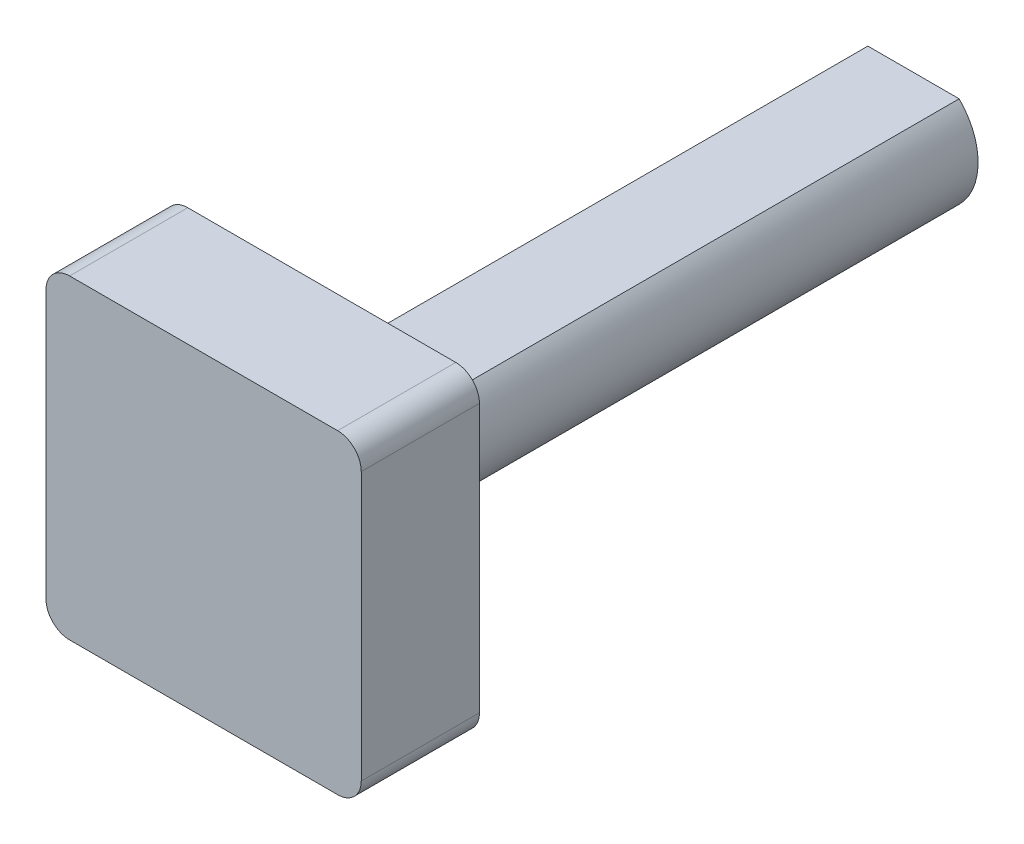
ISO-10303-21;
HEADER;
FILE_DESCRIPTION(('STEP AP214'),'2;1');
FILE_NAME('part.step','',(''),(''),'','','');
FILE_SCHEMA(('AUTOMOTIVE_DESIGN { 1 0 10303 214 1 1 1 1 }'));
ENDSEC;
DATA;
#1=APPLICATION_CONTEXT('core data for automotive mechanical design processes');
#2=APPLICATION_PROTOCOL_DEFINITION('international standard','automotive_design',2000,#1);
#3=PRODUCT_CONTEXT('',#1,'mechanical');
#4=PRODUCT('Part','Part','',(#3));
#5=PRODUCT_RELATED_PRODUCT_CATEGORY('part','',(#4));
#6=PRODUCT_DEFINITION_FORMATION('','',#4);
#7=PRODUCT_DEFINITION_CONTEXT('part definition',#1,'design');
#8=PRODUCT_DEFINITION('design','',#6,#7);
#9=PRODUCT_DEFINITION_SHAPE('','',#8);
#10=(LENGTH_UNIT() NAMED_UNIT(*) SI_UNIT(.MILLI.,.METRE.));
#11=(NAMED_UNIT(*) PLANE_ANGLE_UNIT() SI_UNIT($,.RADIAN.));
#12=(NAMED_UNIT(*) SI_UNIT($,.STERADIAN.) SOLID_ANGLE_UNIT());
#13=UNCERTAINTY_MEASURE_WITH_UNIT(LENGTH_MEASURE(1.E-05),#10,'distance_accuracy_value','');
#14=(GEOMETRIC_REPRESENTATION_CONTEXT(3) GLOBAL_UNCERTAINTY_ASSIGNED_CONTEXT((#13)) GLOBAL_UNIT_ASSIGNED_CONTEXT((#10,
#11,#12)) REPRESENTATION_CONTEXT('',''));
#15=CARTESIAN_POINT('',(0.,0.,0.));
#16=DIRECTION('',(0.,0.,1.));
#17=DIRECTION('',(1.,0.,0.));
#18=AXIS2_PLACEMENT_3D('',#15,#16,#17);
#19=CARTESIAN_POINT('',(0.039843902833861,0.248435462917591,-114.3));
#20=DIRECTION('',(0.,0.,1.));
#21=DIRECTION('',(1.,0.,0.));
#22=AXIS2_PLACEMENT_3D('',#19,#20,#21);
#23=CYLINDRICAL_SURFACE('',#22,10.414);
#24=CARTESIAN_POINT('',(0.039843902833861,0.248435462917591,-19.05));
#25=DIRECTION('',(0.,0.,-1.));
#26=DIRECTION('',(-1.,0.,0.));
#27=AXIS2_PLACEMENT_3D('',#24,#25,#26);
#28=CIRCLE('',#27,10.414);
#29=CARTESIAN_POINT('',(7.39929628569946,-7.11972961560324,-19.05));
#30=VERTEX_POINT('',#29);
#31=CARTESIAN_POINT('',(7.39929628569946,7.61660054143842,-19.05));
#32=VERTEX_POINT('',#31);
#33=EDGE_CURVE('E55',#30,#32,#28,.F.);
#34=ORIENTED_EDGE('',*,*,#33,.F.);
#35=DIRECTION('',(0.,0.,1.));
#36=VECTOR('',#35,1.);
#37=CARTESIAN_POINT('',(7.39929628569946,-7.11972961560324,-114.3));
#38=LINE('',#37,#36);
#39=CARTESIAN_POINT('',(7.39929628569946,-7.11972961560324,-114.3));
#40=VERTEX_POINT('',#39);
#41=EDGE_CURVE('E48',#40,#30,#38,.T.);
#42=ORIENTED_EDGE('',*,*,#41,.F.);
#43=CARTESIAN_POINT('',(0.039843902833861,0.248435462917591,-114.3));
#44=DIRECTION('',(0.,0.,1.));
#45=DIRECTION('',(1.,0.,0.));
#46=AXIS2_PLACEMENT_3D('',#43,#44,#45);
#47=CIRCLE('',#46,10.414);
#48=CARTESIAN_POINT('',(7.39929628569946,7.61660054143842,-114.3));
#49=VERTEX_POINT('',#48);
#50=EDGE_CURVE('E210',#40,#49,#47,.T.);
#51=ORIENTED_EDGE('',*,*,#50,.T.);
#52=DIRECTION('',(0.,0.,1.));
#53=VECTOR('',#52,1.);
#54=CARTESIAN_POINT('',(7.39929628569946,7.61660054143842,-114.3));
#55=LINE('',#54,#53);
#56=EDGE_CURVE('E222',#49,#32,#55,.T.);
#57=ORIENTED_EDGE('',*,*,#56,.T.);
#58=EDGE_LOOP('',(#34,#42,#51,#57));
#59=FACE_BOUND('',#58,.T.);
#60=ADVANCED_FACE('F41',(#59),#23,.T.);
#61=CARTESIAN_POINT('',(-7.31960848003174,-7.11972961560324,-114.3));
#62=DIRECTION('',(0.,-1.,0.));
#63=DIRECTION('',(0.,0.,-1.));
#64=AXIS2_PLACEMENT_3D('',#61,#62,#63);
#65=PLANE('',#64);
#66=DIRECTION('',(1.,0.,0.));
#67=VECTOR('',#66,1.);
#68=CARTESIAN_POINT('',(-7.31960848003174,-7.11972961560324,-19.05));
#69=LINE('',#68,#67);
#70=CARTESIAN_POINT('',(-7.31960848003174,-7.11972961560324,-19.05));
#71=VERTEX_POINT('',#70);
#72=EDGE_CURVE('E62',#71,#30,#69,.T.);
#73=ORIENTED_EDGE('',*,*,#72,.F.);
#74=DIRECTION('',(0.,0.,1.));
#75=VECTOR('',#74,1.);
#76=CARTESIAN_POINT('',(-7.31960848003174,-7.11972961560324,-114.3));
#77=LINE('',#76,#75);
#78=CARTESIAN_POINT('',(-7.31960848003174,-7.11972961560324,-114.3));
#79=VERTEX_POINT('',#78);
#80=EDGE_CURVE('E224',#79,#71,#77,.T.);
#81=ORIENTED_EDGE('',*,*,#80,.F.);
#82=DIRECTION('',(1.,0.,0.));
#83=VECTOR('',#82,1.);
#84=CARTESIAN_POINT('',(-7.31960848003174,-7.11972961560324,-114.3));
#85=LINE('',#84,#83);
#86=EDGE_CURVE('E219',#79,#40,#85,.T.);
#87=ORIENTED_EDGE('',*,*,#86,.T.);
#88=ORIENTED_EDGE('',*,*,#41,.T.);
#89=EDGE_LOOP('',(#73,#81,#87,#88));
#90=FACE_BOUND('',#89,.T.);
#91=ADVANCED_FACE('F236',(#90),#65,.T.);
#92=CARTESIAN_POINT('',(0.039843902833861,0.248435462917591,-114.3));
#93=DIRECTION('',(0.,0.,1.));
#94=DIRECTION('',(1.,0.,0.));
#95=AXIS2_PLACEMENT_3D('',#92,#93,#94);
#96=CYLINDRICAL_SURFACE('',#95,10.414);
#97=CARTESIAN_POINT('',(0.039843902833861,0.248435462917591,-19.05));
#98=DIRECTION('',(0.,0.,-1.));
#99=DIRECTION('',(-1.,0.,0.));
#100=AXIS2_PLACEMENT_3D('',#97,#98,#99);
#101=CIRCLE('',#100,10.414);
#102=CARTESIAN_POINT('',(-7.31960848003174,7.61660054143842,-19.05));
#103=VERTEX_POINT('',#102);
#104=EDGE_CURVE('E194',#103,#71,#101,.F.);
#105=ORIENTED_EDGE('',*,*,#104,.F.);
#106=DIRECTION('',(0.,0.,1.));
#107=VECTOR('',#106,1.);
#108=CARTESIAN_POINT('',(-7.31960848003174,7.61660054143842,-114.3));
#109=LINE('',#108,#107);
#110=CARTESIAN_POINT('',(-7.31960848003174,7.61660054143842,-114.3));
#111=VERTEX_POINT('',#110);
#112=EDGE_CURVE('E226',#111,#103,#109,.T.);
#113=ORIENTED_EDGE('',*,*,#112,.F.);
#114=CARTESIAN_POINT('',(0.039843902833861,0.248435462917591,-114.3));
#115=DIRECTION('',(0.,0.,1.));
#116=DIRECTION('',(1.,0.,0.));
#117=AXIS2_PLACEMENT_3D('',#114,#115,#116);
#118=CIRCLE('',#117,10.414);
#119=EDGE_CURVE('E216',#111,#79,#118,.T.);
#120=ORIENTED_EDGE('',*,*,#119,.T.);
#121=ORIENTED_EDGE('',*,*,#80,.T.);
#122=EDGE_LOOP('',(#105,#113,#120,#121));
#123=FACE_BOUND('',#122,.T.);
#124=ADVANCED_FACE('F233',(#123),#96,.T.);
#125=CARTESIAN_POINT('',(-7.31960848003174,7.61660054143842,-114.3));
#126=DIRECTION('',(0.,1.,0.));
#127=DIRECTION('',(0.,0.,1.));
#128=AXIS2_PLACEMENT_3D('',#125,#126,#127);
#129=PLANE('',#128);
#130=DIRECTION('',(-1.,0.,0.));
#131=VECTOR('',#130,1.);
#132=CARTESIAN_POINT('',(-7.31960848003174,7.61660054143842,-19.05));
#133=LINE('',#132,#131);
#134=EDGE_CURVE('E11',#32,#103,#133,.T.);
#135=ORIENTED_EDGE('',*,*,#134,.F.);
#136=ORIENTED_EDGE('',*,*,#56,.F.);
#137=DIRECTION('',(-1.,0.,0.));
#138=VECTOR('',#137,1.);
#139=CARTESIAN_POINT('',(-7.31960848003174,7.61660054143842,-114.3));
#140=LINE('',#139,#138);
#141=EDGE_CURVE('E213',#49,#111,#140,.T.);
#142=ORIENTED_EDGE('',*,*,#141,.T.);
#143=ORIENTED_EDGE('',*,*,#112,.T.);
#144=EDGE_LOOP('',(#135,#136,#142,#143));
#145=FACE_BOUND('',#144,.T.);
#146=ADVANCED_FACE('F239',(#145),#129,.T.);
#147=CARTESIAN_POINT('',(0.039843902833861,0.248435462917591,-114.3));
#148=DIRECTION('',(0.,0.,1.));
#149=DIRECTION('',(1.,0.,0.));
#150=AXIS2_PLACEMENT_3D('',#147,#148,#149);
#151=PLANE('',#150);
#152=ORIENTED_EDGE('',*,*,#50,.F.);
#153=ORIENTED_EDGE('',*,*,#86,.F.);
#154=ORIENTED_EDGE('',*,*,#119,.F.);
#155=ORIENTED_EDGE('',*,*,#141,.F.);
#156=EDGE_LOOP('',(#152,#153,#154,#155));
#157=FACE_BOUND('',#156,.T.);
#158=ADVANCED_FACE('F238',(#157),#151,.F.);
#159=CARTESIAN_POINT('',(-21.7016181488463,21.6746355526609,-19.05));
#160=DIRECTION('',(0.,0.,1.));
#161=DIRECTION('',(1.,0.,0.));
#162=AXIS2_PLACEMENT_3D('',#159,#160,#161);
#163=CYLINDRICAL_SURFACE('',#162,3.81);
#164=CARTESIAN_POINT('',(-21.7016181488463,21.6746355526609,0.));
#165=DIRECTION('',(0.,0.,1.));
#166=DIRECTION('',(-1.,0.,0.));
#167=AXIS2_PLACEMENT_3D('',#164,#165,#166);
#168=CIRCLE('',#167,3.81);
#169=CARTESIAN_POINT('',(-21.7016181488463,25.4846355526609,0.));
#170=VERTEX_POINT('',#169);
#171=CARTESIAN_POINT('',(-25.5116181488463,21.6746355526608,0.));
#172=VERTEX_POINT('',#171);
#173=EDGE_CURVE('E176',#170,#172,#168,.T.);
#174=ORIENTED_EDGE('',*,*,#173,.F.);
#175=DIRECTION('',(0.,0.,1.));
#176=VECTOR('',#175,1.);
#177=CARTESIAN_POINT('',(-21.7016181488463,25.4846355526609,-19.05));
#178=LINE('',#177,#176);
#179=CARTESIAN_POINT('',(-21.7016181488463,25.4846355526609,-19.05));
#180=VERTEX_POINT('',#179);
#181=EDGE_CURVE('E155',#180,#170,#178,.T.);
#182=ORIENTED_EDGE('',*,*,#181,.F.);
#183=CARTESIAN_POINT('',(-21.7016181488463,21.6746355526609,-19.05));
#184=DIRECTION('',(0.,0.,1.));
#185=DIRECTION('',(-1.,0.,0.));
#186=AXIS2_PLACEMENT_3D('',#183,#184,#185);
#187=CIRCLE('',#186,3.81);
#188=CARTESIAN_POINT('',(-25.5116181488463,21.6746355526608,-19.05));
#189=VERTEX_POINT('',#188);
#190=EDGE_CURVE('E148',#180,#189,#187,.T.);
#191=ORIENTED_EDGE('',*,*,#190,.T.);
#192=DIRECTION('',(0.,0.,1.));
#193=VECTOR('',#192,1.);
#194=CARTESIAN_POINT('',(-25.5116181488463,21.6746355526608,-19.05));
#195=LINE('',#194,#193);
#196=EDGE_CURVE('E130',#189,#172,#195,.T.);
#197=ORIENTED_EDGE('',*,*,#196,.T.);
#198=EDGE_LOOP('',(#174,#182,#191,#197));
#199=FACE_BOUND('',#198,.T.);
#200=ADVANCED_FACE('F154',(#199),#163,.T.);
#201=CARTESIAN_POINT('',(-21.7016181488463,25.4846355526609,-19.05));
#202=DIRECTION('',(0.,1.,0.));
#203=DIRECTION('',(-1.,0.,0.));
#204=AXIS2_PLACEMENT_3D('',#201,#202,#203);
#205=PLANE('',#204);
#206=DIRECTION('',(-1.,0.,0.));
#207=VECTOR('',#206,1.);
#208=CARTESIAN_POINT('',(-21.7016181488463,25.4846355526609,0.));
#209=LINE('',#208,#207);
#210=CARTESIAN_POINT('',(21.501073099459,25.4846355526608,0.));
#211=VERTEX_POINT('',#210);
#212=EDGE_CURVE('E156',#211,#170,#209,.T.);
#213=ORIENTED_EDGE('',*,*,#212,.F.);
#214=DIRECTION('',(0.,0.,1.));
#215=VECTOR('',#214,1.);
#216=CARTESIAN_POINT('',(21.501073099459,25.4846355526608,-19.05));
#217=LINE('',#216,#215);
#218=CARTESIAN_POINT('',(21.501073099459,25.4846355526608,-19.05));
#219=VERTEX_POINT('',#218);
#220=EDGE_CURVE('E195',#219,#211,#217,.T.);
#221=ORIENTED_EDGE('',*,*,#220,.F.);
#222=DIRECTION('',(-1.,0.,0.));
#223=VECTOR('',#222,1.);
#224=CARTESIAN_POINT('',(-21.7016181488463,25.4846355526609,-19.05));
#225=LINE('',#224,#223);
#226=EDGE_CURVE('E141',#219,#180,#225,.T.);
#227=ORIENTED_EDGE('',*,*,#226,.T.);
#228=ORIENTED_EDGE('',*,*,#181,.T.);
#229=EDGE_LOOP('',(#213,#221,#227,#228));
#230=FACE_BOUND('',#229,.T.);
#231=ADVANCED_FACE('F261',(#230),#205,.T.);
#232=CARTESIAN_POINT('',(21.501073099459,21.6746355526608,-19.05));
#233=DIRECTION('',(0.,0.,1.));
#234=DIRECTION('',(1.,0.,0.));
#235=AXIS2_PLACEMENT_3D('',#232,#233,#234);
#236=CYLINDRICAL_SURFACE('',#235,3.81);
#237=CARTESIAN_POINT('',(21.501073099459,21.6746355526608,0.));
#238=DIRECTION('',(0.,0.,1.));
#239=DIRECTION('',(1.,0.,0.));
#240=AXIS2_PLACEMENT_3D('',#237,#238,#239);
#241=CIRCLE('',#240,3.81);
#242=CARTESIAN_POINT('',(25.311073099459,21.6746355526608,0.));
#243=VERTEX_POINT('',#242);
#244=EDGE_CURVE('E159',#243,#211,#241,.T.);
#245=ORIENTED_EDGE('',*,*,#244,.F.);
#246=DIRECTION('',(0.,0.,1.));
#247=VECTOR('',#246,1.);
#248=CARTESIAN_POINT('',(25.311073099459,21.6746355526608,-19.05));
#249=LINE('',#248,#247);
#250=CARTESIAN_POINT('',(25.311073099459,21.6746355526608,-19.05));
#251=VERTEX_POINT('',#250);
#252=EDGE_CURVE('E197',#251,#243,#249,.T.);
#253=ORIENTED_EDGE('',*,*,#252,.F.);
#254=CARTESIAN_POINT('',(21.501073099459,21.6746355526608,-19.05));
#255=DIRECTION('',(0.,0.,1.));
#256=DIRECTION('',(1.,0.,0.));
#257=AXIS2_PLACEMENT_3D('',#254,#255,#256);
#258=CIRCLE('',#257,3.81);
#259=EDGE_CURVE('E172',#251,#219,#258,.T.);
#260=ORIENTED_EDGE('',*,*,#259,.T.);
#261=ORIENTED_EDGE('',*,*,#220,.T.);
#262=EDGE_LOOP('',(#245,#253,#260,#261));
#263=FACE_BOUND('',#262,.T.);
#264=ADVANCED_FACE('F279',(#263),#236,.T.);
#265=CARTESIAN_POINT('',(25.311073099459,-21.5280556956445,-19.05));
#266=DIRECTION('',(1.,0.,0.));
#267=DIRECTION('',(0.,0.,-1.));
#268=AXIS2_PLACEMENT_3D('',#265,#266,#267);
#269=PLANE('',#268);
#270=DIRECTION('',(0.,1.,0.));
#271=VECTOR('',#270,1.);
#272=CARTESIAN_POINT('',(25.311073099459,-21.5280556956445,0.));
#273=LINE('',#272,#271);
#274=CARTESIAN_POINT('',(25.311073099459,-21.5280556956445,0.));
#275=VERTEX_POINT('',#274);
#276=EDGE_CURVE('E188',#275,#243,#273,.T.);
#277=ORIENTED_EDGE('',*,*,#276,.F.);
#278=DIRECTION('',(0.,0.,1.));
#279=VECTOR('',#278,1.);
#280=CARTESIAN_POINT('',(25.311073099459,-21.5280556956445,-19.05));
#281=LINE('',#280,#279);
#282=CARTESIAN_POINT('',(25.311073099459,-21.5280556956445,-19.05));
#283=VERTEX_POINT('',#282);
#284=EDGE_CURVE('E199',#283,#275,#281,.T.);
#285=ORIENTED_EDGE('',*,*,#284,.F.);
#286=DIRECTION('',(0.,1.,0.));
#287=VECTOR('',#286,1.);
#288=CARTESIAN_POINT('',(25.311073099459,-21.5280556956445,-19.05));
#289=LINE('',#288,#287);
#290=EDGE_CURVE('E169',#283,#251,#289,.T.);
#291=ORIENTED_EDGE('',*,*,#290,.T.);
#292=ORIENTED_EDGE('',*,*,#252,.T.);
#293=EDGE_LOOP('',(#277,#285,#291,#292));
#294=FACE_BOUND('',#293,.T.);
#295=ADVANCED_FACE('F275',(#294),#269,.T.);
#296=CARTESIAN_POINT('',(21.501073099459,-21.5280556956445,-19.05));
#297=DIRECTION('',(0.,0.,1.));
#298=DIRECTION('',(1.,0.,0.));
#299=AXIS2_PLACEMENT_3D('',#296,#297,#298);
#300=CYLINDRICAL_SURFACE('',#299,3.81);
#301=CARTESIAN_POINT('',(21.501073099459,-21.5280556956445,0.));
#302=DIRECTION('',(0.,0.,1.));
#303=DIRECTION('',(1.,0.,0.));
#304=AXIS2_PLACEMENT_3D('',#301,#302,#303);
#305=CIRCLE('',#304,3.81);
#306=CARTESIAN_POINT('',(21.501073099459,-25.3380556956445,0.));
#307=VERTEX_POINT('',#306);
#308=EDGE_CURVE('E185',#307,#275,#305,.T.);
#309=ORIENTED_EDGE('',*,*,#308,.F.);
#310=DIRECTION('',(0.,0.,1.));
#311=VECTOR('',#310,1.);
#312=CARTESIAN_POINT('',(21.501073099459,-25.3380556956445,-19.05));
#313=LINE('',#312,#311);
#314=CARTESIAN_POINT('',(21.501073099459,-25.3380556956445,-19.05));
#315=VERTEX_POINT('',#314);
#316=EDGE_CURVE('E201',#315,#307,#313,.T.);
#317=ORIENTED_EDGE('',*,*,#316,.F.);
#318=CARTESIAN_POINT('',(21.501073099459,-21.5280556956445,-19.05));
#319=DIRECTION('',(0.,0.,1.));
#320=DIRECTION('',(1.,0.,0.));
#321=AXIS2_PLACEMENT_3D('',#318,#319,#320);
#322=CIRCLE('',#321,3.81);
#323=EDGE_CURVE('E166',#315,#283,#322,.T.);
#324=ORIENTED_EDGE('',*,*,#323,.T.);
#325=ORIENTED_EDGE('',*,*,#284,.T.);
#326=EDGE_LOOP('',(#309,#317,#324,#325));
#327=FACE_BOUND('',#326,.T.);
#328=ADVANCED_FACE('F271',(#327),#300,.T.);
#329=CARTESIAN_POINT('',(-21.7016181488463,-25.3380556956445,-19.05));
#330=DIRECTION('',(0.,-1.,0.));
#331=DIRECTION('',(0.,0.,-1.));
#332=AXIS2_PLACEMENT_3D('',#329,#330,#331);
#333=PLANE('',#332);
#334=DIRECTION('',(1.,0.,0.));
#335=VECTOR('',#334,1.);
#336=CARTESIAN_POINT('',(-21.7016181488463,-25.3380556956445,0.));
#337=LINE('',#336,#335);
#338=CARTESIAN_POINT('',(-21.7016181488463,-25.3380556956445,0.));
#339=VERTEX_POINT('',#338);
#340=EDGE_CURVE('E182',#339,#307,#337,.T.);
#341=ORIENTED_EDGE('',*,*,#340,.F.);
#342=DIRECTION('',(0.,0.,1.));
#343=VECTOR('',#342,1.);
#344=CARTESIAN_POINT('',(-21.7016181488463,-25.3380556956445,-19.05));
#345=LINE('',#344,#343);
#346=CARTESIAN_POINT('',(-21.7016181488463,-25.3380556956445,-19.05));
#347=VERTEX_POINT('',#346);
#348=EDGE_CURVE('E203',#347,#339,#345,.T.);
#349=ORIENTED_EDGE('',*,*,#348,.F.);
#350=DIRECTION('',(1.,0.,0.));
#351=VECTOR('',#350,1.);
#352=CARTESIAN_POINT('',(-21.7016181488463,-25.3380556956445,-19.05));
#353=LINE('',#352,#351);
#354=EDGE_CURVE('E163',#347,#315,#353,.T.);
#355=ORIENTED_EDGE('',*,*,#354,.T.);
#356=ORIENTED_EDGE('',*,*,#316,.T.);
#357=EDGE_LOOP('',(#341,#349,#355,#356));
#358=FACE_BOUND('',#357,.T.);
#359=ADVANCED_FACE('F267',(#358),#333,.T.);
#360=CARTESIAN_POINT('',(-21.7016181488463,-21.5280556956445,-19.05));
#361=DIRECTION('',(0.,0.,1.));
#362=DIRECTION('',(1.,0.,0.));
#363=AXIS2_PLACEMENT_3D('',#360,#361,#362);
#364=CYLINDRICAL_SURFACE('',#363,3.81);
#365=CARTESIAN_POINT('',(-21.7016181488463,-21.5280556956445,0.));
#366=DIRECTION('',(0.,0.,1.));
#367=DIRECTION('',(-1.,0.,0.));
#368=AXIS2_PLACEMENT_3D('',#365,#366,#367);
#369=CIRCLE('',#368,3.81);
#370=CARTESIAN_POINT('',(-25.5116181488463,-21.5280556956444,0.));
#371=VERTEX_POINT('',#370);
#372=EDGE_CURVE('E179',#371,#339,#369,.T.);
#373=ORIENTED_EDGE('',*,*,#372,.F.);
#374=DIRECTION('',(0.,0.,1.));
#375=VECTOR('',#374,1.);
#376=CARTESIAN_POINT('',(-25.5116181488463,-21.5280556956444,-19.05));
#377=LINE('',#376,#375);
#378=CARTESIAN_POINT('',(-25.5116181488463,-21.5280556956444,-19.05));
#379=VERTEX_POINT('',#378);
#380=EDGE_CURVE('E140',#379,#371,#377,.T.);
#381=ORIENTED_EDGE('',*,*,#380,.F.);
#382=CARTESIAN_POINT('',(-21.7016181488463,-21.5280556956445,-19.05));
#383=DIRECTION('',(0.,0.,1.));
#384=DIRECTION('',(-1.,0.,0.));
#385=AXIS2_PLACEMENT_3D('',#382,#383,#384);
#386=CIRCLE('',#385,3.81);
#387=EDGE_CURVE('E152',#379,#347,#386,.T.);
#388=ORIENTED_EDGE('',*,*,#387,.T.);
#389=ORIENTED_EDGE('',*,*,#348,.T.);
#390=EDGE_LOOP('',(#373,#381,#388,#389));
#391=FACE_BOUND('',#390,.T.);
#392=ADVANCED_FACE('F264',(#391),#364,.T.);
#393=CARTESIAN_POINT('',(-25.5116181488463,-21.5280556956444,-19.05));
#394=DIRECTION('',(-1.,0.,0.));
#395=DIRECTION('',(0.,0.,1.));
#396=AXIS2_PLACEMENT_3D('',#393,#394,#395);
#397=PLANE('',#396);
#398=DIRECTION('',(0.,-1.,0.));
#399=VECTOR('',#398,1.);
#400=CARTESIAN_POINT('',(-25.5116181488463,-21.5280556956444,0.));
#401=LINE('',#400,#399);
#402=EDGE_CURVE('E135',#172,#371,#401,.T.);
#403=ORIENTED_EDGE('',*,*,#402,.F.);
#404=ORIENTED_EDGE('',*,*,#196,.F.);
#405=DIRECTION('',(0.,-1.,0.));
#406=VECTOR('',#405,1.);
#407=CARTESIAN_POINT('',(-25.5116181488463,-21.5280556956444,-19.05));
#408=LINE('',#407,#406);
#409=EDGE_CURVE('E133',#189,#379,#408,.T.);
#410=ORIENTED_EDGE('',*,*,#409,.T.);
#411=ORIENTED_EDGE('',*,*,#380,.T.);
#412=EDGE_LOOP('',(#403,#404,#410,#411));
#413=FACE_BOUND('',#412,.T.);
#414=ADVANCED_FACE('F132',(#413),#397,.T.);
#415=CARTESIAN_POINT('',(-21.7016181488463,21.6746355526609,-19.05));
#416=DIRECTION('',(0.,0.,-1.));
#417=DIRECTION('',(-1.,0.,0.));
#418=AXIS2_PLACEMENT_3D('',#415,#416,#417);
#419=PLANE('',#418);
#420=ORIENTED_EDGE('',*,*,#72,.T.);
#421=ORIENTED_EDGE('',*,*,#33,.T.);
#422=ORIENTED_EDGE('',*,*,#134,.T.);
#423=ORIENTED_EDGE('',*,*,#104,.T.);
#424=EDGE_LOOP('',(#420,#421,#422,#423));
#425=FACE_BOUND('',#424,.T.);
#426=ORIENTED_EDGE('',*,*,#190,.F.);
#427=ORIENTED_EDGE('',*,*,#226,.F.);
#428=ORIENTED_EDGE('',*,*,#259,.F.);
#429=ORIENTED_EDGE('',*,*,#290,.F.);
#430=ORIENTED_EDGE('',*,*,#323,.F.);
#431=ORIENTED_EDGE('',*,*,#354,.F.);
#432=ORIENTED_EDGE('',*,*,#387,.F.);
#433=ORIENTED_EDGE('',*,*,#409,.F.);
#434=EDGE_LOOP('',(#426,#427,#428,#429,#430,#431,#432,#433));
#435=FACE_BOUND('',#434,.T.);
#436=ADVANCED_FACE('F146',(#425,#435),#419,.T.);
#437=CARTESIAN_POINT('',(0.039843902833861,0.248435462917591,0.));
#438=DIRECTION('',(0.,0.,1.));
#439=DIRECTION('',(1.,0.,0.));
#440=AXIS2_PLACEMENT_3D('',#437,#438,#439);
#441=PLANE('',#440);
#442=ORIENTED_EDGE('',*,*,#173,.T.);
#443=ORIENTED_EDGE('',*,*,#402,.T.);
#444=ORIENTED_EDGE('',*,*,#372,.T.);
#445=ORIENTED_EDGE('',*,*,#340,.T.);
#446=ORIENTED_EDGE('',*,*,#308,.T.);
#447=ORIENTED_EDGE('',*,*,#276,.T.);
#448=ORIENTED_EDGE('',*,*,#244,.T.);
#449=ORIENTED_EDGE('',*,*,#212,.T.);
#450=EDGE_LOOP('',(#442,#443,#444,#445,#446,#447,#448,#449));
#451=FACE_BOUND('',#450,.T.);
#452=ADVANCED_FACE('F255',(#451),#441,.T.);
#453=CLOSED_SHELL('',(#60,#91,#124,#146,#158,#200,#231,#264,#295,#328,#359,#392,#414,#436,#452));
#454=MANIFOLD_SOLID_BREP('B2',#453);
#455=ADVANCED_BREP_SHAPE_REPRESENTATION('',(#18,#454),#14);
#456=SHAPE_DEFINITION_REPRESENTATION(#9,#455);
ENDSEC;
END-ISO-10303-21;
